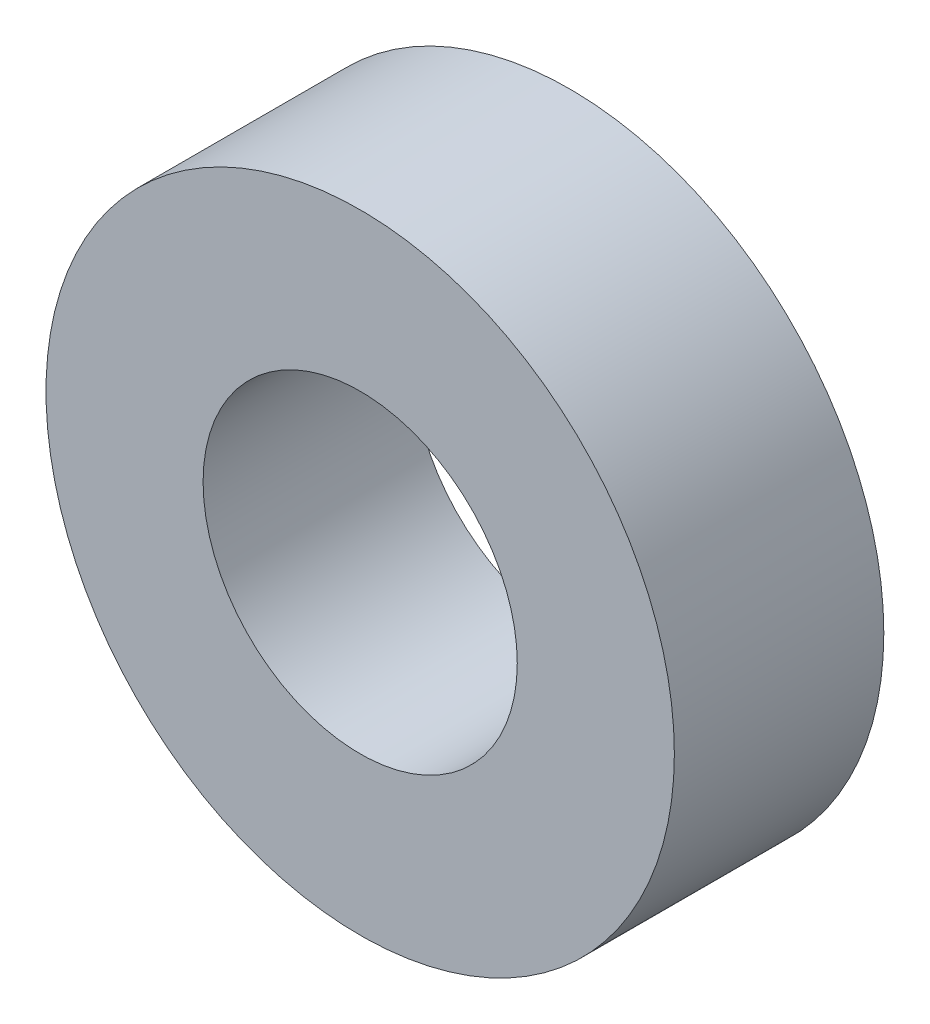
ISO-10303-21;
HEADER;
FILE_DESCRIPTION(('STEP AP214'),'2;1');
FILE_NAME('part.step','',(''),(''),'','','');
FILE_SCHEMA(('AUTOMOTIVE_DESIGN { 1 0 10303 214 1 1 1 1 }'));
ENDSEC;
DATA;
#1=APPLICATION_CONTEXT('core data for automotive mechanical design processes');
#2=APPLICATION_PROTOCOL_DEFINITION('international standard','automotive_design',2000,#1);
#3=PRODUCT_CONTEXT('',#1,'mechanical');
#4=PRODUCT('Part','Part','',(#3));
#5=PRODUCT_RELATED_PRODUCT_CATEGORY('part','',(#4));
#6=PRODUCT_DEFINITION_FORMATION('','',#4);
#7=PRODUCT_DEFINITION_CONTEXT('part definition',#1,'design');
#8=PRODUCT_DEFINITION('design','',#6,#7);
#9=PRODUCT_DEFINITION_SHAPE('','',#8);
#10=(LENGTH_UNIT() NAMED_UNIT(*) SI_UNIT(.MILLI.,.METRE.));
#11=(NAMED_UNIT(*) PLANE_ANGLE_UNIT() SI_UNIT($,.RADIAN.));
#12=(NAMED_UNIT(*) SI_UNIT($,.STERADIAN.) SOLID_ANGLE_UNIT());
#13=UNCERTAINTY_MEASURE_WITH_UNIT(LENGTH_MEASURE(1.E-05),#10,'distance_accuracy_value','');
#14=(GEOMETRIC_REPRESENTATION_CONTEXT(3) GLOBAL_UNCERTAINTY_ASSIGNED_CONTEXT((#13)) GLOBAL_UNIT_ASSIGNED_CONTEXT((#10,
#11,#12)) REPRESENTATION_CONTEXT('',''));
#15=CARTESIAN_POINT('',(0.,0.,0.));
#16=DIRECTION('',(0.,0.,1.));
#17=DIRECTION('',(1.,0.,0.));
#18=AXIS2_PLACEMENT_3D('',#15,#16,#17);
#19=CARTESIAN_POINT('',(256.17494294889,227.32559165554,3.175));
#20=DIRECTION('',(0.,0.,1.));
#21=DIRECTION('',(1.,0.,0.));
#22=AXIS2_PLACEMENT_3D('',#19,#20,#21);
#23=PLANE('',#22);
#24=CARTESIAN_POINT('',(256.17494294889,227.32559165554,3.175));
#25=DIRECTION('',(0.,0.,1.));
#26=DIRECTION('',(1.,0.,0.));
#27=AXIS2_PLACEMENT_3D('',#24,#25,#26);
#28=CIRCLE('',#27,4.76250000000001);
#29=CARTESIAN_POINT('',(260.93744294889,227.32559165554,3.175));
#30=VERTEX_POINT('',#29);
#31=EDGE_CURVE('E11',#30,#30,#28,.T.);
#32=ORIENTED_EDGE('',*,*,#31,.T.);
#33=EDGE_LOOP('',(#32));
#34=FACE_BOUND('',#33,.T.);
#35=CARTESIAN_POINT('',(256.17494294889,227.32559165554,3.175));
#36=DIRECTION('',(0.,0.,1.));
#37=DIRECTION('',(1.,0.,0.));
#38=AXIS2_PLACEMENT_3D('',#35,#36,#37);
#39=CIRCLE('',#38,2.38125);
#40=CARTESIAN_POINT('',(258.55619294889,227.32559165554,3.175));
#41=VERTEX_POINT('',#40);
#42=EDGE_CURVE('E48',#41,#41,#39,.T.);
#43=ORIENTED_EDGE('',*,*,#42,.F.);
#44=EDGE_LOOP('',(#43));
#45=FACE_BOUND('',#44,.T.);
#46=ADVANCED_FACE('F37',(#34,#45),#23,.T.);
#47=CARTESIAN_POINT('',(256.17494294889,227.32559165554,0.));
#48=DIRECTION('',(0.,0.,1.));
#49=DIRECTION('',(1.,0.,0.));
#50=AXIS2_PLACEMENT_3D('',#47,#48,#49);
#51=PLANE('',#50);
#52=CARTESIAN_POINT('',(256.17494294889,227.32559165554,0.));
#53=DIRECTION('',(0.,0.,1.));
#54=DIRECTION('',(1.,0.,0.));
#55=AXIS2_PLACEMENT_3D('',#52,#53,#54);
#56=CIRCLE('',#55,4.76250000000001);
#57=CARTESIAN_POINT('',(260.93744294889,227.32559165554,0.));
#58=VERTEX_POINT('',#57);
#59=EDGE_CURVE('E41',#58,#58,#56,.T.);
#60=ORIENTED_EDGE('',*,*,#59,.F.);
#61=EDGE_LOOP('',(#60));
#62=FACE_BOUND('',#61,.T.);
#63=CARTESIAN_POINT('',(256.17494294889,227.32559165554,0.));
#64=DIRECTION('',(0.,0.,1.));
#65=DIRECTION('',(1.,0.,0.));
#66=AXIS2_PLACEMENT_3D('',#63,#64,#65);
#67=CIRCLE('',#66,2.38125);
#68=CARTESIAN_POINT('',(258.55619294889,227.32559165554,0.));
#69=VERTEX_POINT('',#68);
#70=EDGE_CURVE('E50',#69,#69,#67,.T.);
#71=ORIENTED_EDGE('',*,*,#70,.T.);
#72=EDGE_LOOP('',(#71));
#73=FACE_BOUND('',#72,.T.);
#74=ADVANCED_FACE('F60',(#62,#73),#51,.F.);
#75=CARTESIAN_POINT('',(256.17494294889,227.32559165554,3.175));
#76=DIRECTION('',(0.,0.,-1.));
#77=DIRECTION('',(-1.,0.,0.));
#78=AXIS2_PLACEMENT_3D('',#75,#76,#77);
#79=CYLINDRICAL_SURFACE('',#78,4.76250000000001);
#80=ORIENTED_EDGE('',*,*,#31,.F.);
#81=EDGE_LOOP('',(#80));
#82=FACE_BOUND('',#81,.T.);
#83=ORIENTED_EDGE('',*,*,#59,.T.);
#84=EDGE_LOOP('',(#83));
#85=FACE_BOUND('',#84,.T.);
#86=ADVANCED_FACE('F39',(#82,#85),#79,.T.);
#87=CARTESIAN_POINT('',(256.17494294889,227.32559165554,3.175));
#88=DIRECTION('',(0.,0.,-1.));
#89=DIRECTION('',(-1.,0.,0.));
#90=AXIS2_PLACEMENT_3D('',#87,#88,#89);
#91=CYLINDRICAL_SURFACE('',#90,2.38125);
#92=ORIENTED_EDGE('',*,*,#42,.T.);
#93=EDGE_LOOP('',(#92));
#94=FACE_BOUND('',#93,.T.);
#95=ORIENTED_EDGE('',*,*,#70,.F.);
#96=EDGE_LOOP('',(#95));
#97=FACE_BOUND('',#96,.T.);
#98=ADVANCED_FACE('F56',(#94,#97),#91,.F.);
#99=CLOSED_SHELL('',(#46,#74,#86,#98));
#100=MANIFOLD_SOLID_BREP('B2',#99);
#101=ADVANCED_BREP_SHAPE_REPRESENTATION('',(#18,#100),#14);
#102=SHAPE_DEFINITION_REPRESENTATION(#9,#101);
ENDSEC;
END-ISO-10303-21;
